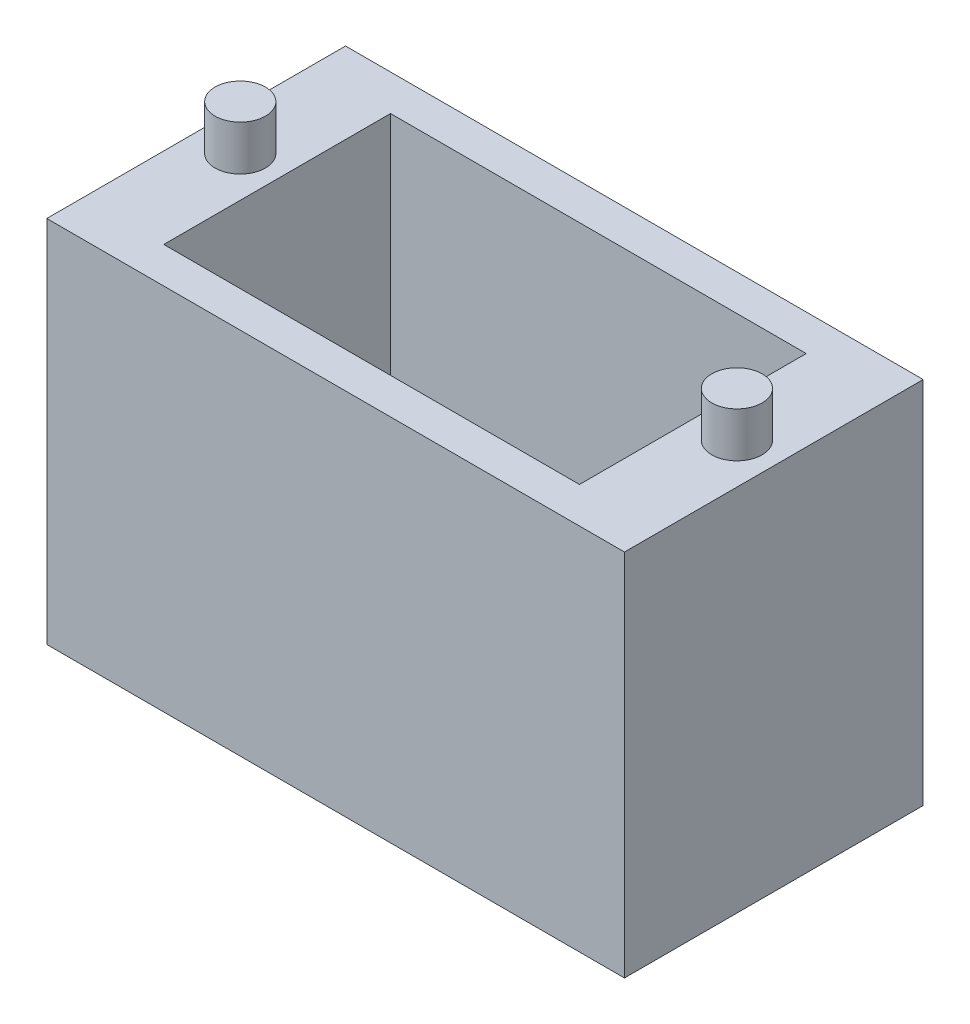
ISO-10303-21;
HEADER;
FILE_DESCRIPTION(('STEP AP214'),'2;1');
FILE_NAME('part.step','',(''),(''),'','','');
FILE_SCHEMA(('AUTOMOTIVE_DESIGN { 1 0 10303 214 1 1 1 1 }'));
ENDSEC;
DATA;
#1=APPLICATION_CONTEXT('core data for automotive mechanical design processes');
#2=APPLICATION_PROTOCOL_DEFINITION('international standard','automotive_design',2000,#1);
#3=PRODUCT_CONTEXT('',#1,'mechanical');
#4=PRODUCT('Part','Part','',(#3));
#5=PRODUCT_RELATED_PRODUCT_CATEGORY('part','',(#4));
#6=PRODUCT_DEFINITION_FORMATION('','',#4);
#7=PRODUCT_DEFINITION_CONTEXT('part definition',#1,'design');
#8=PRODUCT_DEFINITION('design','',#6,#7);
#9=PRODUCT_DEFINITION_SHAPE('','',#8);
#10=(LENGTH_UNIT() NAMED_UNIT(*) SI_UNIT(.MILLI.,.METRE.));
#11=(NAMED_UNIT(*) PLANE_ANGLE_UNIT() SI_UNIT($,.RADIAN.));
#12=(NAMED_UNIT(*) SI_UNIT($,.STERADIAN.) SOLID_ANGLE_UNIT());
#13=UNCERTAINTY_MEASURE_WITH_UNIT(LENGTH_MEASURE(1.E-05),#10,'distance_accuracy_value','');
#14=(GEOMETRIC_REPRESENTATION_CONTEXT(3) GLOBAL_UNCERTAINTY_ASSIGNED_CONTEXT((#13)) GLOBAL_UNIT_ASSIGNED_CONTEXT((#10,
#11,#12)) REPRESENTATION_CONTEXT('',''));
#15=CARTESIAN_POINT('',(0.,0.,0.));
#16=DIRECTION('',(0.,0.,1.));
#17=DIRECTION('',(1.,0.,0.));
#18=AXIS2_PLACEMENT_3D('',#15,#16,#17);
#19=CARTESIAN_POINT('',(16.05,-4.5,12.2));
#20=DIRECTION('',(-1.,0.,0.));
#21=DIRECTION('',(0.,0.,1.));
#22=AXIS2_PLACEMENT_3D('',#19,#20,#21);
#23=PLANE('',#22);
#24=DIRECTION('',(0.,0.,-1.));
#25=VECTOR('',#24,1.);
#26=CARTESIAN_POINT('',(16.05,17.,12.2));
#27=LINE('',#26,#25);
#28=CARTESIAN_POINT('',(16.05,17.,14.6));
#29=VERTEX_POINT('',#28);
#30=CARTESIAN_POINT('',(16.05,17.,-2.));
#31=VERTEX_POINT('',#30);
#32=EDGE_CURVE('E216',#29,#31,#27,.T.);
#33=ORIENTED_EDGE('',*,*,#32,.F.);
#34=DIRECTION('',(0.,1.,0.));
#35=VECTOR('',#34,1.);
#36=CARTESIAN_POINT('',(16.05,17.,14.6));
#37=LINE('',#36,#35);
#38=CARTESIAN_POINT('',(16.05,-3.5,14.6));
#39=VERTEX_POINT('',#38);
#40=EDGE_CURVE('E125',#39,#29,#37,.T.);
#41=ORIENTED_EDGE('',*,*,#40,.F.);
#42=DIRECTION('',(0.,0.,-1.));
#43=VECTOR('',#42,1.);
#44=CARTESIAN_POINT('',(16.05,-3.5,12.2));
#45=LINE('',#44,#43);
#46=CARTESIAN_POINT('',(16.05,-3.5,-2.));
#47=VERTEX_POINT('',#46);
#48=EDGE_CURVE('E120',#39,#47,#45,.T.);
#49=ORIENTED_EDGE('',*,*,#48,.T.);
#50=DIRECTION('',(0.,-1.,0.));
#51=VECTOR('',#50,1.);
#52=CARTESIAN_POINT('',(16.05,17.,-2.));
#53=LINE('',#52,#51);
#54=EDGE_CURVE('E123',#31,#47,#53,.T.);
#55=ORIENTED_EDGE('',*,*,#54,.F.);
#56=EDGE_LOOP('',(#33,#41,#49,#55));
#57=FACE_BOUND('',#56,.T.);
#58=ADVANCED_FACE('F37',(#57),#23,.F.);
#59=CARTESIAN_POINT('',(11.55,0.,12.2));
#60=DIRECTION('',(1.,0.,0.));
#61=DIRECTION('',(0.,0.,-1.));
#62=AXIS2_PLACEMENT_3D('',#59,#60,#61);
#63=PLANE('',#62);
#64=DIRECTION('',(0.,-1.,0.));
#65=VECTOR('',#64,1.);
#66=CARTESIAN_POINT('',(11.55,0.,0.));
#67=LINE('',#66,#65);
#68=CARTESIAN_POINT('',(11.55,17.,0.));
#69=VERTEX_POINT('',#68);
#70=CARTESIAN_POINT('',(11.55,0.,0.));
#71=VERTEX_POINT('',#70);
#72=EDGE_CURVE('E193',#69,#71,#67,.T.);
#73=ORIENTED_EDGE('',*,*,#72,.T.);
#74=DIRECTION('',(0.,0.,-1.));
#75=VECTOR('',#74,1.);
#76=CARTESIAN_POINT('',(11.55,0.,12.2));
#77=LINE('',#76,#75);
#78=CARTESIAN_POINT('',(11.55,0.,12.6));
#79=VERTEX_POINT('',#78);
#80=EDGE_CURVE('E210',#79,#71,#77,.T.);
#81=ORIENTED_EDGE('',*,*,#80,.F.);
#82=DIRECTION('',(0.,-1.,0.));
#83=VECTOR('',#82,1.);
#84=CARTESIAN_POINT('',(11.55,17.,12.6));
#85=LINE('',#84,#83);
#86=CARTESIAN_POINT('',(11.55,17.,12.6));
#87=VERTEX_POINT('',#86);
#88=EDGE_CURVE('E172',#87,#79,#85,.T.);
#89=ORIENTED_EDGE('',*,*,#88,.F.);
#90=DIRECTION('',(0.,0.,-1.));
#91=VECTOR('',#90,1.);
#92=CARTESIAN_POINT('',(11.55,17.,12.2));
#93=LINE('',#92,#91);
#94=EDGE_CURVE('E213',#87,#69,#93,.T.);
#95=ORIENTED_EDGE('',*,*,#94,.T.);
#96=EDGE_LOOP('',(#73,#81,#89,#95));
#97=FACE_BOUND('',#96,.T.);
#98=ADVANCED_FACE('F256',(#97),#63,.F.);
#99=CARTESIAN_POINT('',(-11.55,0.,12.2));
#100=DIRECTION('',(0.,-1.,0.));
#101=DIRECTION('',(0.,0.,-1.));
#102=AXIS2_PLACEMENT_3D('',#99,#100,#101);
#103=PLANE('',#102);
#104=DIRECTION('',(-1.,0.,0.));
#105=VECTOR('',#104,1.);
#106=CARTESIAN_POINT('',(-11.55,0.,0.));
#107=LINE('',#106,#105);
#108=CARTESIAN_POINT('',(-8.55000000000001,0.,0.));
#109=VERTEX_POINT('',#108);
#110=EDGE_CURVE('E196',#71,#109,#107,.T.);
#111=ORIENTED_EDGE('',*,*,#110,.T.);
#112=DIRECTION('',(0.,0.,1.));
#113=VECTOR('',#112,1.);
#114=CARTESIAN_POINT('',(-8.55000000000001,0.,12.2));
#115=LINE('',#114,#113);
#116=CARTESIAN_POINT('',(-8.55000000000001,0.,8.5));
#117=VERTEX_POINT('',#116);
#118=EDGE_CURVE('E188',#109,#117,#115,.T.);
#119=ORIENTED_EDGE('',*,*,#118,.T.);
#120=DIRECTION('',(-1.,0.,0.));
#121=VECTOR('',#120,1.);
#122=CARTESIAN_POINT('',(-11.55,0.,8.5));
#123=LINE('',#122,#121);
#124=CARTESIAN_POINT('',(-11.55,0.,8.5));
#125=VERTEX_POINT('',#124);
#126=EDGE_CURVE('E58',#117,#125,#123,.T.);
#127=ORIENTED_EDGE('',*,*,#126,.T.);
#128=DIRECTION('',(0.,0.,-1.));
#129=VECTOR('',#128,1.);
#130=CARTESIAN_POINT('',(-11.55,0.,12.2));
#131=LINE('',#130,#129);
#132=CARTESIAN_POINT('',(-11.55,0.,12.6));
#133=VERTEX_POINT('',#132);
#134=EDGE_CURVE('E207',#133,#125,#131,.T.);
#135=ORIENTED_EDGE('',*,*,#134,.F.);
#136=DIRECTION('',(-1.,0.,0.));
#137=VECTOR('',#136,1.);
#138=CARTESIAN_POINT('',(11.55,0.,12.6));
#139=LINE('',#138,#137);
#140=EDGE_CURVE('E164',#79,#133,#139,.T.);
#141=ORIENTED_EDGE('',*,*,#140,.F.);
#142=ORIENTED_EDGE('',*,*,#80,.T.);
#143=EDGE_LOOP('',(#111,#119,#127,#135,#141,#142));
#144=FACE_BOUND('',#143,.T.);
#145=ADVANCED_FACE('F260',(#144),#103,.F.);
#146=CARTESIAN_POINT('',(-11.55,0.,12.2));
#147=DIRECTION('',(-1.,0.,0.));
#148=DIRECTION('',(0.,0.,1.));
#149=AXIS2_PLACEMENT_3D('',#146,#147,#148);
#150=PLANE('',#149);
#151=DIRECTION('',(0.,-1.,0.));
#152=VECTOR('',#151,1.);
#153=CARTESIAN_POINT('',(-11.55,17.,8.5));
#154=LINE('',#153,#152);
#155=CARTESIAN_POINT('',(-11.55,-3.5,8.5));
#156=VERTEX_POINT('',#155);
#157=EDGE_CURVE('E185',#125,#156,#154,.T.);
#158=ORIENTED_EDGE('',*,*,#157,.T.);
#159=DIRECTION('',(0.,0.,-1.));
#160=VECTOR('',#159,1.);
#161=CARTESIAN_POINT('',(-11.55,-3.5,12.2));
#162=LINE('',#161,#160);
#163=CARTESIAN_POINT('',(-11.55,-3.5,0.));
#164=VERTEX_POINT('',#163);
#165=EDGE_CURVE('E130',#156,#164,#162,.T.);
#166=ORIENTED_EDGE('',*,*,#165,.T.);
#167=DIRECTION('',(0.,1.,0.));
#168=VECTOR('',#167,1.);
#169=CARTESIAN_POINT('',(-11.55,0.,0.));
#170=LINE('',#169,#168);
#171=CARTESIAN_POINT('',(-11.55,17.,0.));
#172=VERTEX_POINT('',#171);
#173=EDGE_CURVE('E199',#164,#172,#170,.T.);
#174=ORIENTED_EDGE('',*,*,#173,.T.);
#175=DIRECTION('',(0.,0.,-1.));
#176=VECTOR('',#175,1.);
#177=CARTESIAN_POINT('',(-11.55,17.,12.2));
#178=LINE('',#177,#176);
#179=CARTESIAN_POINT('',(-11.55,17.,12.6));
#180=VERTEX_POINT('',#179);
#181=EDGE_CURVE('E204',#180,#172,#178,.T.);
#182=ORIENTED_EDGE('',*,*,#181,.F.);
#183=DIRECTION('',(0.,1.,0.));
#184=VECTOR('',#183,1.);
#185=CARTESIAN_POINT('',(-11.55,0.,12.6));
#186=LINE('',#185,#184);
#187=EDGE_CURVE('E169',#133,#180,#186,.T.);
#188=ORIENTED_EDGE('',*,*,#187,.F.);
#189=ORIENTED_EDGE('',*,*,#134,.T.);
#190=EDGE_LOOP('',(#158,#166,#174,#182,#188,#189));
#191=FACE_BOUND('',#190,.T.);
#192=ADVANCED_FACE('F231',(#191),#150,.F.);
#193=CARTESIAN_POINT('',(-11.55,17.,12.2));
#194=DIRECTION('',(0.,-1.,0.));
#195=DIRECTION('',(0.,0.,-1.));
#196=AXIS2_PLACEMENT_3D('',#193,#194,#195);
#197=PLANE('',#196);
#198=DIRECTION('',(1.,0.,0.));
#199=VECTOR('',#198,1.);
#200=CARTESIAN_POINT('',(16.05,17.,0.));
#201=LINE('',#200,#199);
#202=EDGE_CURVE('E145',#172,#69,#201,.T.);
#203=ORIENTED_EDGE('',*,*,#202,.T.);
#204=ORIENTED_EDGE('',*,*,#94,.F.);
#205=DIRECTION('',(-1.,0.,0.));
#206=VECTOR('',#205,1.);
#207=CARTESIAN_POINT('',(-16.05,17.,12.6));
#208=LINE('',#207,#206);
#209=EDGE_CURVE('E153',#87,#180,#208,.T.);
#210=ORIENTED_EDGE('',*,*,#209,.T.);
#211=ORIENTED_EDGE('',*,*,#181,.T.);
#212=EDGE_LOOP('',(#203,#204,#210,#211));
#213=FACE_BOUND('',#212,.T.);
#214=CARTESIAN_POINT('',(-13.8,17.,6.1));
#215=DIRECTION('',(0.,-1.,0.));
#216=DIRECTION('',(0.,0.,-1.));
#217=AXIS2_PLACEMENT_3D('',#214,#215,#216);
#218=CIRCLE('',#217,1.4);
#219=CARTESIAN_POINT('',(-13.8,17.,4.7));
#220=VERTEX_POINT('',#219);
#221=EDGE_CURVE('E44',#220,#220,#218,.F.);
#222=ORIENTED_EDGE('',*,*,#221,.F.);
#223=EDGE_LOOP('',(#222));
#224=FACE_BOUND('',#223,.T.);
#225=ORIENTED_EDGE('',*,*,#32,.T.);
#226=DIRECTION('',(1.,0.,0.));
#227=VECTOR('',#226,1.);
#228=CARTESIAN_POINT('',(16.05,17.,-2.));
#229=LINE('',#228,#227);
#230=CARTESIAN_POINT('',(-16.05,17.,-2.));
#231=VERTEX_POINT('',#230);
#232=EDGE_CURVE('E144',#231,#31,#229,.T.);
#233=ORIENTED_EDGE('',*,*,#232,.F.);
#234=DIRECTION('',(0.,0.,-1.));
#235=VECTOR('',#234,1.);
#236=CARTESIAN_POINT('',(-16.05,17.,12.2));
#237=LINE('',#236,#235);
#238=CARTESIAN_POINT('',(-16.05,17.,14.6));
#239=VERTEX_POINT('',#238);
#240=EDGE_CURVE('E202',#239,#231,#237,.T.);
#241=ORIENTED_EDGE('',*,*,#240,.F.);
#242=DIRECTION('',(-1.,0.,0.));
#243=VECTOR('',#242,1.);
#244=CARTESIAN_POINT('',(-16.05,17.,14.6));
#245=LINE('',#244,#243);
#246=EDGE_CURVE('E161',#29,#239,#245,.T.);
#247=ORIENTED_EDGE('',*,*,#246,.F.);
#248=EDGE_LOOP('',(#225,#233,#241,#247));
#249=FACE_BOUND('',#248,.T.);
#250=CARTESIAN_POINT('',(13.8,17.,6.1));
#251=DIRECTION('',(0.,-1.,0.));
#252=DIRECTION('',(0.,0.,-1.));
#253=AXIS2_PLACEMENT_3D('',#250,#251,#252);
#254=CIRCLE('',#253,1.4);
#255=CARTESIAN_POINT('',(13.8,17.,4.7));
#256=VERTEX_POINT('',#255);
#257=EDGE_CURVE('E220',#256,#256,#254,.F.);
#258=ORIENTED_EDGE('',*,*,#257,.F.);
#259=EDGE_LOOP('',(#258));
#260=FACE_BOUND('',#259,.T.);
#261=ADVANCED_FACE('F227',(#213,#224,#249,#260),#197,.F.);
#262=CARTESIAN_POINT('',(-16.05,-4.5,12.2));
#263=DIRECTION('',(1.,0.,0.));
#264=DIRECTION('',(0.,0.,-1.));
#265=AXIS2_PLACEMENT_3D('',#262,#263,#264);
#266=PLANE('',#265);
#267=ORIENTED_EDGE('',*,*,#240,.T.);
#268=DIRECTION('',(0.,1.,0.));
#269=VECTOR('',#268,1.);
#270=CARTESIAN_POINT('',(-16.05,17.,-2.));
#271=LINE('',#270,#269);
#272=CARTESIAN_POINT('',(-16.05,-3.5,-2.));
#273=VERTEX_POINT('',#272);
#274=EDGE_CURVE('E139',#273,#231,#271,.T.);
#275=ORIENTED_EDGE('',*,*,#274,.F.);
#276=DIRECTION('',(0.,0.,-1.));
#277=VECTOR('',#276,1.);
#278=CARTESIAN_POINT('',(-16.05,-3.5,12.2));
#279=LINE('',#278,#277);
#280=CARTESIAN_POINT('',(-16.05,-3.5,14.6));
#281=VERTEX_POINT('',#280);
#282=EDGE_CURVE('E135',#281,#273,#279,.T.);
#283=ORIENTED_EDGE('',*,*,#282,.F.);
#284=DIRECTION('',(0.,-1.,0.));
#285=VECTOR('',#284,1.);
#286=CARTESIAN_POINT('',(-16.05,17.,14.6));
#287=LINE('',#286,#285);
#288=EDGE_CURVE('E155',#239,#281,#287,.T.);
#289=ORIENTED_EDGE('',*,*,#288,.F.);
#290=EDGE_LOOP('',(#267,#275,#283,#289));
#291=FACE_BOUND('',#290,.T.);
#292=ADVANCED_FACE('F230',(#291),#266,.F.);
#293=CARTESIAN_POINT('',(-11.55,17.,8.5));
#294=DIRECTION('',(0.,0.,1.));
#295=DIRECTION('',(1.,0.,0.));
#296=AXIS2_PLACEMENT_3D('',#293,#294,#295);
#297=PLANE('',#296);
#298=DIRECTION('',(0.,-1.,0.));
#299=VECTOR('',#298,1.);
#300=CARTESIAN_POINT('',(-8.55000000000001,17.,8.5));
#301=LINE('',#300,#299);
#302=CARTESIAN_POINT('',(-8.55000000000001,-3.5,8.5));
#303=VERTEX_POINT('',#302);
#304=EDGE_CURVE('E184',#117,#303,#301,.T.);
#305=ORIENTED_EDGE('',*,*,#304,.T.);
#306=DIRECTION('',(-1.,0.,0.));
#307=VECTOR('',#306,1.);
#308=CARTESIAN_POINT('',(-11.55,-3.5,8.5));
#309=LINE('',#308,#307);
#310=EDGE_CURVE('E51',#303,#156,#309,.T.);
#311=ORIENTED_EDGE('',*,*,#310,.T.);
#312=ORIENTED_EDGE('',*,*,#157,.F.);
#313=ORIENTED_EDGE('',*,*,#126,.F.);
#314=EDGE_LOOP('',(#305,#311,#312,#313));
#315=FACE_BOUND('',#314,.T.);
#316=ADVANCED_FACE('F250',(#315),#297,.F.);
#317=CARTESIAN_POINT('',(-8.55000000000001,17.,8.5));
#318=DIRECTION('',(1.,0.,0.));
#319=DIRECTION('',(0.,0.,-1.));
#320=AXIS2_PLACEMENT_3D('',#317,#318,#319);
#321=PLANE('',#320);
#322=DIRECTION('',(0.,1.,0.));
#323=VECTOR('',#322,1.);
#324=CARTESIAN_POINT('',(-8.55000000000001,0.,0.));
#325=LINE('',#324,#323);
#326=CARTESIAN_POINT('',(-8.55000000000001,-3.5,0.));
#327=VERTEX_POINT('',#326);
#328=EDGE_CURVE('E218',#327,#109,#325,.T.);
#329=ORIENTED_EDGE('',*,*,#328,.F.);
#330=DIRECTION('',(0.,0.,1.));
#331=VECTOR('',#330,1.);
#332=CARTESIAN_POINT('',(-8.55000000000001,-3.5,8.5));
#333=LINE('',#332,#331);
#334=EDGE_CURVE('E11',#327,#303,#333,.T.);
#335=ORIENTED_EDGE('',*,*,#334,.T.);
#336=ORIENTED_EDGE('',*,*,#304,.F.);
#337=ORIENTED_EDGE('',*,*,#118,.F.);
#338=EDGE_LOOP('',(#329,#335,#336,#337));
#339=FACE_BOUND('',#338,.T.);
#340=ADVANCED_FACE('F241',(#339),#321,.F.);
#341=CARTESIAN_POINT('',(13.8,19.5,6.1));
#342=DIRECTION('',(0.,-1.,0.));
#343=DIRECTION('',(0.,0.,-1.));
#344=AXIS2_PLACEMENT_3D('',#341,#342,#343);
#345=CYLINDRICAL_SURFACE('',#344,1.4);
#346=CARTESIAN_POINT('',(13.8,19.5,6.1));
#347=DIRECTION('',(0.,1.,0.));
#348=DIRECTION('',(0.,0.,1.));
#349=AXIS2_PLACEMENT_3D('',#346,#347,#348);
#350=CIRCLE('',#349,1.4);
#351=CARTESIAN_POINT('',(13.8,19.5,7.5));
#352=VERTEX_POINT('',#351);
#353=EDGE_CURVE('E181',#352,#352,#350,.T.);
#354=ORIENTED_EDGE('',*,*,#353,.F.);
#355=EDGE_LOOP('',(#354));
#356=FACE_BOUND('',#355,.T.);
#357=ORIENTED_EDGE('',*,*,#257,.T.);
#358=EDGE_LOOP('',(#357));
#359=FACE_BOUND('',#358,.T.);
#360=ADVANCED_FACE('F238',(#356,#359),#345,.T.);
#361=CARTESIAN_POINT('',(13.8,19.5,6.1));
#362=DIRECTION('',(0.,1.,0.));
#363=DIRECTION('',(0.,0.,1.));
#364=AXIS2_PLACEMENT_3D('',#361,#362,#363);
#365=PLANE('',#364);
#366=ORIENTED_EDGE('',*,*,#353,.T.);
#367=EDGE_LOOP('',(#366));
#368=FACE_BOUND('',#367,.T.);
#369=ADVANCED_FACE('F240',(#368),#365,.T.);
#370=CARTESIAN_POINT('',(-13.8,19.5,6.1));
#371=DIRECTION('',(0.,-1.,0.));
#372=DIRECTION('',(0.,0.,-1.));
#373=AXIS2_PLACEMENT_3D('',#370,#371,#372);
#374=CYLINDRICAL_SURFACE('',#373,1.4);
#375=CARTESIAN_POINT('',(-13.8,19.5,6.1));
#376=DIRECTION('',(0.,1.,0.));
#377=DIRECTION('',(0.,0.,-1.));
#378=AXIS2_PLACEMENT_3D('',#375,#376,#377);
#379=CIRCLE('',#378,1.4);
#380=CARTESIAN_POINT('',(-13.8,19.5,4.7));
#381=VERTEX_POINT('',#380);
#382=EDGE_CURVE('E129',#381,#381,#379,.T.);
#383=ORIENTED_EDGE('',*,*,#382,.F.);
#384=EDGE_LOOP('',(#383));
#385=FACE_BOUND('',#384,.T.);
#386=ORIENTED_EDGE('',*,*,#221,.T.);
#387=EDGE_LOOP('',(#386));
#388=FACE_BOUND('',#387,.T.);
#389=ADVANCED_FACE('F225',(#385,#388),#374,.T.);
#390=CARTESIAN_POINT('',(-13.8,19.5,6.1));
#391=DIRECTION('',(0.,-1.,0.));
#392=DIRECTION('',(0.,0.,-1.));
#393=AXIS2_PLACEMENT_3D('',#390,#391,#392);
#394=PLANE('',#393);
#395=ORIENTED_EDGE('',*,*,#382,.T.);
#396=EDGE_LOOP('',(#395));
#397=FACE_BOUND('',#396,.T.);
#398=ADVANCED_FACE('F287',(#397),#394,.F.);
#399=CARTESIAN_POINT('',(-28.2909149984795,-3.5,12.2));
#400=DIRECTION('',(0.,1.,0.));
#401=DIRECTION('',(0.,0.,1.));
#402=AXIS2_PLACEMENT_3D('',#399,#400,#401);
#403=PLANE('',#402);
#404=DIRECTION('',(-1.,0.,0.));
#405=VECTOR('',#404,1.);
#406=CARTESIAN_POINT('',(16.05,-3.5,-2.));
#407=LINE('',#406,#405);
#408=EDGE_CURVE('E133',#47,#273,#407,.T.);
#409=ORIENTED_EDGE('',*,*,#408,.F.);
#410=ORIENTED_EDGE('',*,*,#48,.F.);
#411=DIRECTION('',(1.,0.,0.));
#412=VECTOR('',#411,1.);
#413=CARTESIAN_POINT('',(-16.05,-3.5,14.6));
#414=LINE('',#413,#412);
#415=EDGE_CURVE('E158',#281,#39,#414,.T.);
#416=ORIENTED_EDGE('',*,*,#415,.F.);
#417=ORIENTED_EDGE('',*,*,#282,.T.);
#418=EDGE_LOOP('',(#409,#410,#416,#417));
#419=FACE_BOUND('',#418,.T.);
#420=ORIENTED_EDGE('',*,*,#334,.F.);
#421=DIRECTION('',(-1.,0.,0.));
#422=VECTOR('',#421,1.);
#423=CARTESIAN_POINT('',(16.05,-3.5,0.));
#424=LINE('',#423,#422);
#425=EDGE_CURVE('E148',#327,#164,#424,.T.);
#426=ORIENTED_EDGE('',*,*,#425,.T.);
#427=ORIENTED_EDGE('',*,*,#165,.F.);
#428=ORIENTED_EDGE('',*,*,#310,.F.);
#429=EDGE_LOOP('',(#420,#426,#427,#428));
#430=FACE_BOUND('',#429,.T.);
#431=ADVANCED_FACE('F134',(#419,#430),#403,.F.);
#432=CARTESIAN_POINT('',(0.,0.,12.6));
#433=DIRECTION('',(0.,0.,1.));
#434=DIRECTION('',(1.,0.,0.));
#435=AXIS2_PLACEMENT_3D('',#432,#433,#434);
#436=PLANE('',#435);
#437=ORIENTED_EDGE('',*,*,#140,.T.);
#438=ORIENTED_EDGE('',*,*,#187,.T.);
#439=ORIENTED_EDGE('',*,*,#209,.F.);
#440=ORIENTED_EDGE('',*,*,#88,.T.);
#441=EDGE_LOOP('',(#437,#438,#439,#440));
#442=FACE_BOUND('',#441,.T.);
#443=ADVANCED_FACE('F286',(#442),#436,.F.);
#444=CARTESIAN_POINT('',(0.,0.,14.6));
#445=DIRECTION('',(0.,0.,1.));
#446=DIRECTION('',(1.,0.,0.));
#447=AXIS2_PLACEMENT_3D('',#444,#445,#446);
#448=PLANE('',#447);
#449=ORIENTED_EDGE('',*,*,#288,.T.);
#450=ORIENTED_EDGE('',*,*,#415,.T.);
#451=ORIENTED_EDGE('',*,*,#40,.T.);
#452=ORIENTED_EDGE('',*,*,#246,.T.);
#453=EDGE_LOOP('',(#449,#450,#451,#452));
#454=FACE_BOUND('',#453,.T.);
#455=ADVANCED_FACE('F293',(#454),#448,.T.);
#456=CARTESIAN_POINT('',(0.,0.,0.));
#457=DIRECTION('',(0.,0.,-1.));
#458=DIRECTION('',(-1.,0.,0.));
#459=AXIS2_PLACEMENT_3D('',#456,#457,#458);
#460=PLANE('',#459);
#461=ORIENTED_EDGE('',*,*,#202,.F.);
#462=ORIENTED_EDGE('',*,*,#173,.F.);
#463=ORIENTED_EDGE('',*,*,#425,.F.);
#464=ORIENTED_EDGE('',*,*,#328,.T.);
#465=ORIENTED_EDGE('',*,*,#110,.F.);
#466=ORIENTED_EDGE('',*,*,#72,.F.);
#467=EDGE_LOOP('',(#461,#462,#463,#464,#465,#466));
#468=FACE_BOUND('',#467,.T.);
#469=ADVANCED_FACE('F280',(#468),#460,.F.);
#470=CARTESIAN_POINT('',(0.,0.,-2.));
#471=DIRECTION('',(0.,0.,-1.));
#472=DIRECTION('',(-1.,0.,0.));
#473=AXIS2_PLACEMENT_3D('',#470,#471,#472);
#474=PLANE('',#473);
#475=ORIENTED_EDGE('',*,*,#54,.T.);
#476=ORIENTED_EDGE('',*,*,#408,.T.);
#477=ORIENTED_EDGE('',*,*,#274,.T.);
#478=ORIENTED_EDGE('',*,*,#232,.T.);
#479=EDGE_LOOP('',(#475,#476,#477,#478));
#480=FACE_BOUND('',#479,.T.);
#481=ADVANCED_FACE('F142',(#480),#474,.T.);
#482=CLOSED_SHELL('',(#58,#98,#145,#192,#261,#292,#316,#340,#360,#369,#389,#398,#431,#443,#455,
#469,#481));
#483=MANIFOLD_SOLID_BREP('B2',#482);
#484=ADVANCED_BREP_SHAPE_REPRESENTATION('',(#18,#483),#14);
#485=SHAPE_DEFINITION_REPRESENTATION(#9,#484);
ENDSEC;
END-ISO-10303-21;
